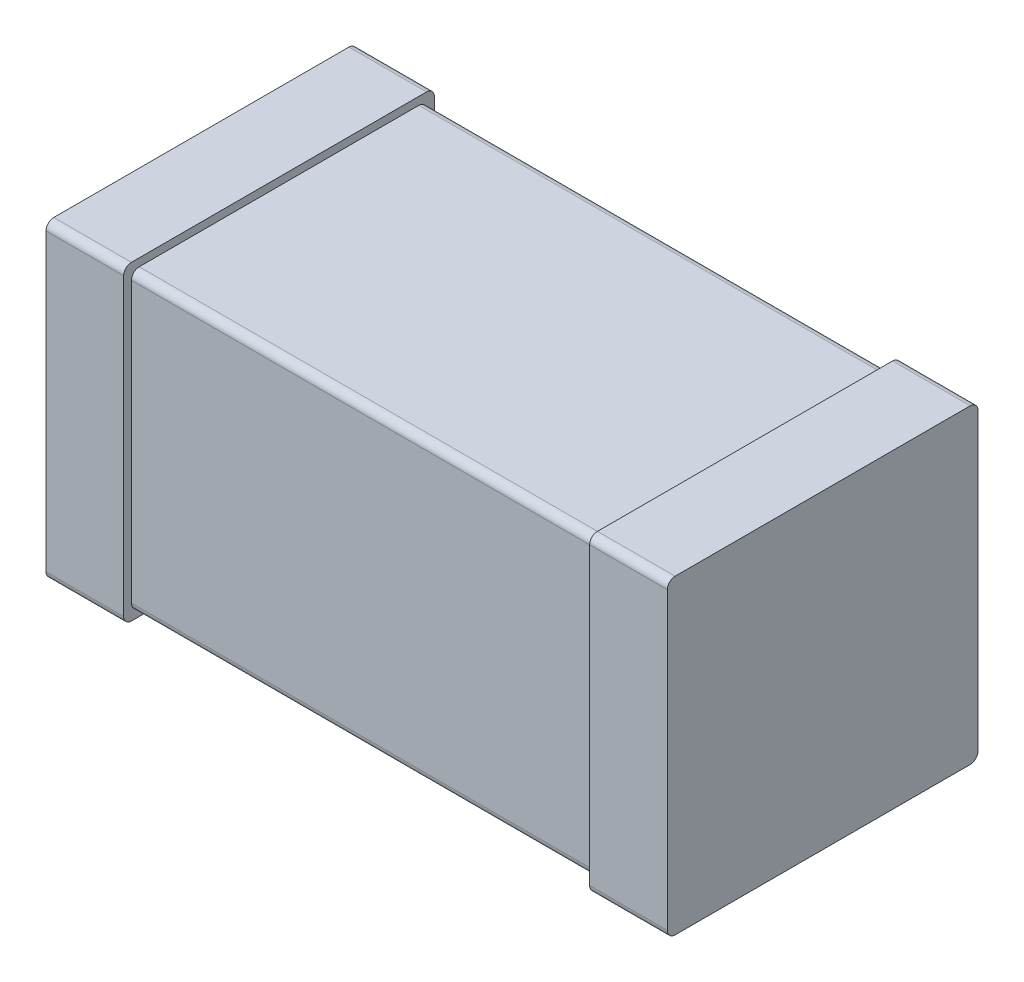
ISO-10303-21;
HEADER;
FILE_DESCRIPTION(('STEP AP214'),'2;1');
FILE_NAME('part.step','',(''),(''),'','','');
FILE_SCHEMA(('AUTOMOTIVE_DESIGN { 1 0 10303 214 1 1 1 1 }'));
ENDSEC;
DATA;
#1=APPLICATION_CONTEXT('core data for automotive mechanical design processes');
#2=APPLICATION_PROTOCOL_DEFINITION('international standard','automotive_design',2000,#1);
#3=PRODUCT_CONTEXT('',#1,'mechanical');
#4=PRODUCT('Part','Part','',(#3));
#5=PRODUCT_RELATED_PRODUCT_CATEGORY('part','',(#4));
#6=PRODUCT_DEFINITION_FORMATION('','',#4);
#7=PRODUCT_DEFINITION_CONTEXT('part definition',#1,'design');
#8=PRODUCT_DEFINITION('design','',#6,#7);
#9=PRODUCT_DEFINITION_SHAPE('','',#8);
#10=(LENGTH_UNIT() NAMED_UNIT(*) SI_UNIT(.MILLI.,.METRE.));
#11=(NAMED_UNIT(*) PLANE_ANGLE_UNIT() SI_UNIT($,.RADIAN.));
#12=(NAMED_UNIT(*) SI_UNIT($,.STERADIAN.) SOLID_ANGLE_UNIT());
#13=UNCERTAINTY_MEASURE_WITH_UNIT(LENGTH_MEASURE(1.E-05),#10,'distance_accuracy_value','');
#14=(GEOMETRIC_REPRESENTATION_CONTEXT(3) GLOBAL_UNCERTAINTY_ASSIGNED_CONTEXT((#13)) GLOBAL_UNIT_ASSIGNED_CONTEXT((#10,
#11,#12)) REPRESENTATION_CONTEXT('',''));
#15=CARTESIAN_POINT('',(0.,0.,0.));
#16=DIRECTION('',(0.,0.,1.));
#17=DIRECTION('',(1.,0.,0.));
#18=AXIS2_PLACEMENT_3D('',#15,#16,#17);
#19=CARTESIAN_POINT('',(1.6,-0.8,0.));
#20=DIRECTION('',(1.,0.,0.));
#21=DIRECTION('',(0.,1.,0.));
#22=AXIS2_PLACEMENT_3D('',#19,#20,#21);
#23=PLANE('',#22);
#24=DIRECTION('',(0.,0.,1.));
#25=VECTOR('',#24,1.);
#26=CARTESIAN_POINT('',(1.6,-0.8,0.));
#27=LINE('',#26,#25);
#28=CARTESIAN_POINT('',(1.6,-0.8,0.04));
#29=VERTEX_POINT('',#28);
#30=CARTESIAN_POINT('',(1.6,-0.8,1.56));
#31=VERTEX_POINT('',#30);
#32=EDGE_CURVE('E357',#29,#31,#27,.T.);
#33=ORIENTED_EDGE('',*,*,#32,.F.);
#34=CARTESIAN_POINT('',(1.6,-0.76,0.04));
#35=DIRECTION('',(1.,0.,0.));
#36=DIRECTION('',(0.,0.,1.));
#37=AXIS2_PLACEMENT_3D('',#34,#35,#36);
#38=CIRCLE('',#37,0.04);
#39=CARTESIAN_POINT('',(1.6,-0.76,0.));
#40=VERTEX_POINT('',#39);
#41=EDGE_CURVE('E377',#29,#40,#38,.T.);
#42=ORIENTED_EDGE('',*,*,#41,.T.);
#43=DIRECTION('',(0.,1.,0.));
#44=VECTOR('',#43,1.);
#45=CARTESIAN_POINT('',(1.6,-0.8,0.));
#46=LINE('',#45,#44);
#47=CARTESIAN_POINT('',(1.6,0.76,0.));
#48=VERTEX_POINT('',#47);
#49=EDGE_CURVE('E335',#40,#48,#46,.T.);
#50=ORIENTED_EDGE('',*,*,#49,.T.);
#51=CARTESIAN_POINT('',(1.6,0.76,0.04));
#52=DIRECTION('',(-1.,0.,0.));
#53=DIRECTION('',(0.,0.,1.));
#54=AXIS2_PLACEMENT_3D('',#51,#52,#53);
#55=CIRCLE('',#54,0.04);
#56=CARTESIAN_POINT('',(1.6,0.8,0.04));
#57=VERTEX_POINT('',#56);
#58=EDGE_CURVE('E370',#57,#48,#55,.T.);
#59=ORIENTED_EDGE('',*,*,#58,.F.);
#60=DIRECTION('',(0.,0.,1.));
#61=VECTOR('',#60,1.);
#62=CARTESIAN_POINT('',(1.6,0.8,0.));
#63=LINE('',#62,#61);
#64=CARTESIAN_POINT('',(1.6,0.8,1.56));
#65=VERTEX_POINT('',#64);
#66=EDGE_CURVE('E11',#57,#65,#63,.T.);
#67=ORIENTED_EDGE('',*,*,#66,.T.);
#68=CARTESIAN_POINT('',(1.6,0.76,1.56));
#69=DIRECTION('',(1.,0.,0.));
#70=DIRECTION('',(0.,0.,1.));
#71=AXIS2_PLACEMENT_3D('',#68,#69,#70);
#72=CIRCLE('',#71,0.04);
#73=CARTESIAN_POINT('',(1.6,0.76,1.6));
#74=VERTEX_POINT('',#73);
#75=EDGE_CURVE('E367',#65,#74,#72,.T.);
#76=ORIENTED_EDGE('',*,*,#75,.T.);
#77=DIRECTION('',(0.,1.,0.));
#78=VECTOR('',#77,1.);
#79=CARTESIAN_POINT('',(1.6,-0.8,1.6));
#80=LINE('',#79,#78);
#81=CARTESIAN_POINT('',(1.6,-0.76,1.6));
#82=VERTEX_POINT('',#81);
#83=EDGE_CURVE('E330',#82,#74,#80,.T.);
#84=ORIENTED_EDGE('',*,*,#83,.F.);
#85=CARTESIAN_POINT('',(1.6,-0.76,1.56));
#86=DIRECTION('',(-1.,0.,0.));
#87=DIRECTION('',(0.,0.,1.));
#88=AXIS2_PLACEMENT_3D('',#85,#86,#87);
#89=CIRCLE('',#88,0.04);
#90=EDGE_CURVE('E381',#31,#82,#89,.T.);
#91=ORIENTED_EDGE('',*,*,#90,.F.);
#92=EDGE_LOOP('',(#33,#42,#50,#59,#67,#76,#84,#91));
#93=FACE_BOUND('',#92,.T.);
#94=ADVANCED_FACE('F16',(#93),#23,.T.);
#95=CARTESIAN_POINT('',(1.2,0.8,0.));
#96=DIRECTION('',(0.,1.,0.));
#97=DIRECTION('',(1.,0.,0.));
#98=AXIS2_PLACEMENT_3D('',#95,#96,#97);
#99=PLANE('',#98);
#100=ORIENTED_EDGE('',*,*,#66,.F.);
#101=DIRECTION('',(1.,0.,0.));
#102=VECTOR('',#101,1.);
#103=CARTESIAN_POINT('',(1.2,0.8,0.04));
#104=LINE('',#103,#102);
#105=CARTESIAN_POINT('',(1.2,0.8,0.04));
#106=VERTEX_POINT('',#105);
#107=EDGE_CURVE('E425',#106,#57,#104,.T.);
#108=ORIENTED_EDGE('',*,*,#107,.F.);
#109=DIRECTION('',(0.,0.,1.));
#110=VECTOR('',#109,1.);
#111=CARTESIAN_POINT('',(1.2,0.8,0.));
#112=LINE('',#111,#110);
#113=CARTESIAN_POINT('',(1.2,0.8,1.56));
#114=VERTEX_POINT('',#113);
#115=EDGE_CURVE('E400',#106,#114,#112,.T.);
#116=ORIENTED_EDGE('',*,*,#115,.T.);
#117=DIRECTION('',(1.,0.,0.));
#118=VECTOR('',#117,1.);
#119=CARTESIAN_POINT('',(1.2,0.8,1.56));
#120=LINE('',#119,#118);
#121=EDGE_CURVE('E27',#114,#65,#120,.T.);
#122=ORIENTED_EDGE('',*,*,#121,.T.);
#123=EDGE_LOOP('',(#100,#108,#116,#122));
#124=FACE_BOUND('',#123,.T.);
#125=ADVANCED_FACE('F493',(#124),#99,.T.);
#126=CARTESIAN_POINT('',(1.2,0.76,1.56));
#127=DIRECTION('',(1.,0.,0.));
#128=DIRECTION('',(0.,1.,0.));
#129=AXIS2_PLACEMENT_3D('',#126,#127,#128);
#130=CYLINDRICAL_SURFACE('',#129,0.04);
#131=CARTESIAN_POINT('',(1.2,0.76,1.56));
#132=DIRECTION('',(1.,0.,0.));
#133=DIRECTION('',(0.,0.,1.));
#134=AXIS2_PLACEMENT_3D('',#131,#132,#133);
#135=CIRCLE('',#134,0.04);
#136=CARTESIAN_POINT('',(1.2,0.76,1.6));
#137=VERTEX_POINT('',#136);
#138=EDGE_CURVE('E346',#114,#137,#135,.T.);
#139=ORIENTED_EDGE('',*,*,#138,.T.);
#140=DIRECTION('',(1.,0.,0.));
#141=VECTOR('',#140,1.);
#142=CARTESIAN_POINT('',(1.2,0.76,1.6));
#143=LINE('',#142,#141);
#144=EDGE_CURVE('E334',#137,#74,#143,.T.);
#145=ORIENTED_EDGE('',*,*,#144,.T.);
#146=ORIENTED_EDGE('',*,*,#75,.F.);
#147=ORIENTED_EDGE('',*,*,#121,.F.);
#148=EDGE_LOOP('',(#139,#145,#146,#147));
#149=FACE_BOUND('',#148,.T.);
#150=ADVANCED_FACE('F497',(#149),#130,.T.);
#151=CARTESIAN_POINT('',(1.2,0.76,0.04));
#152=DIRECTION('',(1.,0.,0.));
#153=DIRECTION('',(0.,1.,0.));
#154=AXIS2_PLACEMENT_3D('',#151,#152,#153);
#155=CYLINDRICAL_SURFACE('',#154,0.04);
#156=ORIENTED_EDGE('',*,*,#107,.T.);
#157=ORIENTED_EDGE('',*,*,#58,.T.);
#158=DIRECTION('',(1.,0.,0.));
#159=VECTOR('',#158,1.);
#160=CARTESIAN_POINT('',(1.2,0.76,0.));
#161=LINE('',#160,#159);
#162=CARTESIAN_POINT('',(1.2,0.76,0.));
#163=VERTEX_POINT('',#162);
#164=EDGE_CURVE('E417',#163,#48,#161,.T.);
#165=ORIENTED_EDGE('',*,*,#164,.F.);
#166=CARTESIAN_POINT('',(1.2,0.76,0.04));
#167=DIRECTION('',(-1.,0.,0.));
#168=DIRECTION('',(0.,0.,1.));
#169=AXIS2_PLACEMENT_3D('',#166,#167,#168);
#170=CIRCLE('',#169,0.04);
#171=EDGE_CURVE('E395',#106,#163,#170,.T.);
#172=ORIENTED_EDGE('',*,*,#171,.F.);
#173=EDGE_LOOP('',(#156,#157,#165,#172));
#174=FACE_BOUND('',#173,.T.);
#175=ADVANCED_FACE('F518',(#174),#155,.T.);
#176=CARTESIAN_POINT('',(1.2,-0.8,1.6));
#177=DIRECTION('',(0.,0.,1.));
#178=DIRECTION('',(1.,0.,0.));
#179=AXIS2_PLACEMENT_3D('',#176,#177,#178);
#180=PLANE('',#179);
#181=DIRECTION('',(0.,1.,0.));
#182=VECTOR('',#181,1.);
#183=CARTESIAN_POINT('',(1.2,-0.8,1.6));
#184=LINE('',#183,#182);
#185=CARTESIAN_POINT('',(1.2,-0.76,1.6));
#186=VERTEX_POINT('',#185);
#187=EDGE_CURVE('E342',#186,#137,#184,.T.);
#188=ORIENTED_EDGE('',*,*,#187,.F.);
#189=DIRECTION('',(1.,0.,0.));
#190=VECTOR('',#189,1.);
#191=CARTESIAN_POINT('',(1.2,-0.76,1.6));
#192=LINE('',#191,#190);
#193=EDGE_CURVE('E411',#186,#82,#192,.T.);
#194=ORIENTED_EDGE('',*,*,#193,.T.);
#195=ORIENTED_EDGE('',*,*,#83,.T.);
#196=ORIENTED_EDGE('',*,*,#144,.F.);
#197=EDGE_LOOP('',(#188,#194,#195,#196));
#198=FACE_BOUND('',#197,.T.);
#199=ADVANCED_FACE('F501',(#198),#180,.T.);
#200=CARTESIAN_POINT('',(1.2,-0.8,0.));
#201=DIRECTION('',(0.,0.,1.));
#202=DIRECTION('',(1.,0.,0.));
#203=AXIS2_PLACEMENT_3D('',#200,#201,#202);
#204=PLANE('',#203);
#205=ORIENTED_EDGE('',*,*,#164,.T.);
#206=ORIENTED_EDGE('',*,*,#49,.F.);
#207=DIRECTION('',(1.,0.,0.));
#208=VECTOR('',#207,1.);
#209=CARTESIAN_POINT('',(1.2,-0.76,0.));
#210=LINE('',#209,#208);
#211=CARTESIAN_POINT('',(1.2,-0.76,0.));
#212=VERTEX_POINT('',#211);
#213=EDGE_CURVE('E382',#212,#40,#210,.T.);
#214=ORIENTED_EDGE('',*,*,#213,.F.);
#215=DIRECTION('',(0.,1.,0.));
#216=VECTOR('',#215,1.);
#217=CARTESIAN_POINT('',(1.2,-0.8,0.));
#218=LINE('',#217,#216);
#219=EDGE_CURVE('E399',#212,#163,#218,.T.);
#220=ORIENTED_EDGE('',*,*,#219,.T.);
#221=EDGE_LOOP('',(#205,#206,#214,#220));
#222=FACE_BOUND('',#221,.T.);
#223=ADVANCED_FACE('F515',(#222),#204,.F.);
#224=CARTESIAN_POINT('',(1.2,-0.76,1.56));
#225=DIRECTION('',(1.,0.,0.));
#226=DIRECTION('',(0.,-1.,0.));
#227=AXIS2_PLACEMENT_3D('',#224,#225,#226);
#228=CYLINDRICAL_SURFACE('',#227,0.04);
#229=DIRECTION('',(1.,0.,0.));
#230=VECTOR('',#229,1.);
#231=CARTESIAN_POINT('',(1.2,-0.8,1.56));
#232=LINE('',#231,#230);
#233=CARTESIAN_POINT('',(1.2,-0.8,1.56));
#234=VERTEX_POINT('',#233);
#235=EDGE_CURVE('E336',#234,#31,#232,.T.);
#236=ORIENTED_EDGE('',*,*,#235,.T.);
#237=ORIENTED_EDGE('',*,*,#90,.T.);
#238=ORIENTED_EDGE('',*,*,#193,.F.);
#239=CARTESIAN_POINT('',(1.2,-0.76,1.56));
#240=DIRECTION('',(-1.,0.,0.));
#241=DIRECTION('',(0.,0.,1.));
#242=AXIS2_PLACEMENT_3D('',#239,#240,#241);
#243=CIRCLE('',#242,0.04);
#244=EDGE_CURVE('E329',#234,#186,#243,.T.);
#245=ORIENTED_EDGE('',*,*,#244,.F.);
#246=EDGE_LOOP('',(#236,#237,#238,#245));
#247=FACE_BOUND('',#246,.T.);
#248=ADVANCED_FACE('F18',(#247),#228,.T.);
#249=CARTESIAN_POINT('',(1.2,-0.76,0.04));
#250=DIRECTION('',(1.,0.,0.));
#251=DIRECTION('',(0.,-1.,0.));
#252=AXIS2_PLACEMENT_3D('',#249,#250,#251);
#253=CYLINDRICAL_SURFACE('',#252,0.04);
#254=CARTESIAN_POINT('',(1.2,-0.76,0.04));
#255=DIRECTION('',(1.,0.,0.));
#256=DIRECTION('',(0.,0.,1.));
#257=AXIS2_PLACEMENT_3D('',#254,#255,#256);
#258=CIRCLE('',#257,0.04);
#259=CARTESIAN_POINT('',(1.2,-0.8,0.04));
#260=VERTEX_POINT('',#259);
#261=EDGE_CURVE('E386',#260,#212,#258,.T.);
#262=ORIENTED_EDGE('',*,*,#261,.T.);
#263=ORIENTED_EDGE('',*,*,#213,.T.);
#264=ORIENTED_EDGE('',*,*,#41,.F.);
#265=DIRECTION('',(1.,0.,0.));
#266=VECTOR('',#265,1.);
#267=CARTESIAN_POINT('',(1.2,-0.8,0.04));
#268=LINE('',#267,#266);
#269=EDGE_CURVE('E340',#260,#29,#268,.T.);
#270=ORIENTED_EDGE('',*,*,#269,.F.);
#271=EDGE_LOOP('',(#262,#263,#264,#270));
#272=FACE_BOUND('',#271,.T.);
#273=ADVANCED_FACE('F513',(#272),#253,.T.);
#274=CARTESIAN_POINT('',(1.2,-0.8,0.));
#275=DIRECTION('',(0.,1.,0.));
#276=DIRECTION('',(1.,0.,0.));
#277=AXIS2_PLACEMENT_3D('',#274,#275,#276);
#278=PLANE('',#277);
#279=ORIENTED_EDGE('',*,*,#235,.F.);
#280=DIRECTION('',(0.,0.,1.));
#281=VECTOR('',#280,1.);
#282=CARTESIAN_POINT('',(1.2,-0.8,0.));
#283=LINE('',#282,#281);
#284=EDGE_CURVE('E341',#260,#234,#283,.T.);
#285=ORIENTED_EDGE('',*,*,#284,.F.);
#286=ORIENTED_EDGE('',*,*,#269,.T.);
#287=ORIENTED_EDGE('',*,*,#32,.T.);
#288=EDGE_LOOP('',(#279,#285,#286,#287));
#289=FACE_BOUND('',#288,.T.);
#290=ADVANCED_FACE('F506',(#289),#278,.F.);
#291=CARTESIAN_POINT('',(1.2,-0.8,0.));
#292=DIRECTION('',(1.,0.,0.));
#293=DIRECTION('',(0.,1.,0.));
#294=AXIS2_PLACEMENT_3D('',#291,#292,#293);
#295=PLANE('',#294);
#296=DIRECTION('',(0.,1.,0.));
#297=VECTOR('',#296,1.);
#298=CARTESIAN_POINT('',(1.2,-0.76,0.04));
#299=LINE('',#298,#297);
#300=CARTESIAN_POINT('',(1.2,-0.72,0.04));
#301=VERTEX_POINT('',#300);
#302=CARTESIAN_POINT('',(1.2,0.72,0.04));
#303=VERTEX_POINT('',#302);
#304=EDGE_CURVE('E269',#301,#303,#299,.T.);
#305=ORIENTED_EDGE('',*,*,#304,.T.);
#306=CARTESIAN_POINT('',(1.2,0.72,0.08));
#307=DIRECTION('',(-1.,0.,0.));
#308=DIRECTION('',(0.,0.,1.));
#309=AXIS2_PLACEMENT_3D('',#306,#307,#308);
#310=CIRCLE('',#309,0.04);
#311=CARTESIAN_POINT('',(1.2,0.76,0.08));
#312=VERTEX_POINT('',#311);
#313=EDGE_CURVE('E316',#312,#303,#310,.T.);
#314=ORIENTED_EDGE('',*,*,#313,.F.);
#315=DIRECTION('',(0.,0.,1.));
#316=VECTOR('',#315,1.);
#317=CARTESIAN_POINT('',(1.2,0.76,0.04));
#318=LINE('',#317,#316);
#319=CARTESIAN_POINT('',(1.2,0.76,1.52));
#320=VERTEX_POINT('',#319);
#321=EDGE_CURVE('E319',#312,#320,#318,.T.);
#322=ORIENTED_EDGE('',*,*,#321,.T.);
#323=CARTESIAN_POINT('',(1.2,0.72,1.52));
#324=DIRECTION('',(1.,0.,0.));
#325=DIRECTION('',(0.,0.,1.));
#326=AXIS2_PLACEMENT_3D('',#323,#324,#325);
#327=CIRCLE('',#326,0.04);
#328=CARTESIAN_POINT('',(1.2,0.72,1.56));
#329=VERTEX_POINT('',#328);
#330=EDGE_CURVE('E321',#320,#329,#327,.T.);
#331=ORIENTED_EDGE('',*,*,#330,.T.);
#332=DIRECTION('',(0.,1.,0.));
#333=VECTOR('',#332,1.);
#334=CARTESIAN_POINT('',(1.2,-0.76,1.56));
#335=LINE('',#334,#333);
#336=CARTESIAN_POINT('',(1.2,-0.72,1.56));
#337=VERTEX_POINT('',#336);
#338=EDGE_CURVE('E279',#337,#329,#335,.T.);
#339=ORIENTED_EDGE('',*,*,#338,.F.);
#340=CARTESIAN_POINT('',(1.2,-0.72,1.52));
#341=DIRECTION('',(-1.,0.,0.));
#342=DIRECTION('',(0.,0.,1.));
#343=AXIS2_PLACEMENT_3D('',#340,#341,#342);
#344=CIRCLE('',#343,0.04);
#345=CARTESIAN_POINT('',(1.2,-0.76,1.52));
#346=VERTEX_POINT('',#345);
#347=EDGE_CURVE('E186',#346,#337,#344,.T.);
#348=ORIENTED_EDGE('',*,*,#347,.F.);
#349=DIRECTION('',(0.,0.,1.));
#350=VECTOR('',#349,1.);
#351=CARTESIAN_POINT('',(1.2,-0.76,0.04));
#352=LINE('',#351,#350);
#353=CARTESIAN_POINT('',(1.2,-0.76,0.08));
#354=VERTEX_POINT('',#353);
#355=EDGE_CURVE('E175',#354,#346,#352,.T.);
#356=ORIENTED_EDGE('',*,*,#355,.F.);
#357=CARTESIAN_POINT('',(1.2,-0.72,0.08));
#358=DIRECTION('',(1.,0.,0.));
#359=DIRECTION('',(0.,0.,1.));
#360=AXIS2_PLACEMENT_3D('',#357,#358,#359);
#361=CIRCLE('',#360,0.04);
#362=EDGE_CURVE('E284',#354,#301,#361,.T.);
#363=ORIENTED_EDGE('',*,*,#362,.T.);
#364=EDGE_LOOP('',(#305,#314,#322,#331,#339,#348,#356,#363));
#365=FACE_BOUND('',#364,.T.);
#366=ORIENTED_EDGE('',*,*,#244,.T.);
#367=ORIENTED_EDGE('',*,*,#187,.T.);
#368=ORIENTED_EDGE('',*,*,#138,.F.);
#369=ORIENTED_EDGE('',*,*,#115,.F.);
#370=ORIENTED_EDGE('',*,*,#171,.T.);
#371=ORIENTED_EDGE('',*,*,#219,.F.);
#372=ORIENTED_EDGE('',*,*,#261,.F.);
#373=ORIENTED_EDGE('',*,*,#284,.T.);
#374=EDGE_LOOP('',(#366,#367,#368,#369,#370,#371,#372,#373));
#375=FACE_BOUND('',#374,.T.);
#376=ADVANCED_FACE('F509',(#365,#375),#295,.F.);
#377=CARTESIAN_POINT('',(-1.2,-0.76,0.04));
#378=DIRECTION('',(0.,1.,0.));
#379=DIRECTION('',(1.,0.,0.));
#380=AXIS2_PLACEMENT_3D('',#377,#378,#379);
#381=PLANE('',#380);
#382=DIRECTION('',(1.,0.,0.));
#383=VECTOR('',#382,1.);
#384=CARTESIAN_POINT('',(-1.2,-0.76,1.52));
#385=LINE('',#384,#383);
#386=CARTESIAN_POINT('',(-1.2,-0.76,1.52));
#387=VERTEX_POINT('',#386);
#388=EDGE_CURVE('E276',#387,#346,#385,.T.);
#389=ORIENTED_EDGE('',*,*,#388,.F.);
#390=DIRECTION('',(0.,0.,1.));
#391=VECTOR('',#390,1.);
#392=CARTESIAN_POINT('',(-1.2,-0.76,0.04));
#393=LINE('',#392,#391);
#394=CARTESIAN_POINT('',(-1.2,-0.76,0.08));
#395=VERTEX_POINT('',#394);
#396=EDGE_CURVE('E310',#395,#387,#393,.T.);
#397=ORIENTED_EDGE('',*,*,#396,.F.);
#398=DIRECTION('',(1.,0.,0.));
#399=VECTOR('',#398,1.);
#400=CARTESIAN_POINT('',(-1.2,-0.76,0.08));
#401=LINE('',#400,#399);
#402=EDGE_CURVE('E434',#395,#354,#401,.T.);
#403=ORIENTED_EDGE('',*,*,#402,.T.);
#404=ORIENTED_EDGE('',*,*,#355,.T.);
#405=EDGE_LOOP('',(#389,#397,#403,#404));
#406=FACE_BOUND('',#405,.T.);
#407=ADVANCED_FACE('F576',(#406),#381,.F.);
#408=CARTESIAN_POINT('',(-1.2,-0.72,1.52));
#409=DIRECTION('',(1.,0.,0.));
#410=DIRECTION('',(0.,-1.,0.));
#411=AXIS2_PLACEMENT_3D('',#408,#409,#410);
#412=CYLINDRICAL_SURFACE('',#411,0.04);
#413=ORIENTED_EDGE('',*,*,#388,.T.);
#414=ORIENTED_EDGE('',*,*,#347,.T.);
#415=DIRECTION('',(1.,0.,0.));
#416=VECTOR('',#415,1.);
#417=CARTESIAN_POINT('',(-1.2,-0.72,1.56));
#418=LINE('',#417,#416);
#419=CARTESIAN_POINT('',(-1.2,-0.72,1.56));
#420=VERTEX_POINT('',#419);
#421=EDGE_CURVE('E325',#420,#337,#418,.T.);
#422=ORIENTED_EDGE('',*,*,#421,.F.);
#423=CARTESIAN_POINT('',(-1.2,-0.72,1.52));
#424=DIRECTION('',(-1.,0.,0.));
#425=DIRECTION('',(0.,0.,1.));
#426=AXIS2_PLACEMENT_3D('',#423,#424,#425);
#427=CIRCLE('',#426,0.04);
#428=EDGE_CURVE('E305',#387,#420,#427,.T.);
#429=ORIENTED_EDGE('',*,*,#428,.F.);
#430=EDGE_LOOP('',(#413,#414,#422,#429));
#431=FACE_BOUND('',#430,.T.);
#432=ADVANCED_FACE('F565',(#431),#412,.T.);
#433=CARTESIAN_POINT('',(-1.2,-0.76,1.56));
#434=DIRECTION('',(0.,0.,1.));
#435=DIRECTION('',(1.,0.,0.));
#436=AXIS2_PLACEMENT_3D('',#433,#434,#435);
#437=PLANE('',#436);
#438=DIRECTION('',(0.,1.,0.));
#439=VECTOR('',#438,1.);
#440=CARTESIAN_POINT('',(-1.2,-0.76,1.56));
#441=LINE('',#440,#439);
#442=CARTESIAN_POINT('',(-1.2,0.72,1.56));
#443=VERTEX_POINT('',#442);
#444=EDGE_CURVE('E309',#420,#443,#441,.T.);
#445=ORIENTED_EDGE('',*,*,#444,.F.);
#446=ORIENTED_EDGE('',*,*,#421,.T.);
#447=ORIENTED_EDGE('',*,*,#338,.T.);
#448=DIRECTION('',(1.,0.,0.));
#449=VECTOR('',#448,1.);
#450=CARTESIAN_POINT('',(-1.2,0.72,1.56));
#451=LINE('',#450,#449);
#452=EDGE_CURVE('E326',#443,#329,#451,.T.);
#453=ORIENTED_EDGE('',*,*,#452,.F.);
#454=EDGE_LOOP('',(#445,#446,#447,#453));
#455=FACE_BOUND('',#454,.T.);
#456=ADVANCED_FACE('F561',(#455),#437,.T.);
#457=CARTESIAN_POINT('',(-1.2,0.72,1.52));
#458=DIRECTION('',(1.,0.,0.));
#459=DIRECTION('',(0.,1.,0.));
#460=AXIS2_PLACEMENT_3D('',#457,#458,#459);
#461=CYLINDRICAL_SURFACE('',#460,0.04);
#462=CARTESIAN_POINT('',(-1.2,0.72,1.52));
#463=DIRECTION('',(1.,0.,0.));
#464=DIRECTION('',(0.,0.,1.));
#465=AXIS2_PLACEMENT_3D('',#462,#463,#464);
#466=CIRCLE('',#465,0.04);
#467=CARTESIAN_POINT('',(-1.2,0.76,1.52));
#468=VERTEX_POINT('',#467);
#469=EDGE_CURVE('E315',#468,#443,#466,.T.);
#470=ORIENTED_EDGE('',*,*,#469,.T.);
#471=ORIENTED_EDGE('',*,*,#452,.T.);
#472=ORIENTED_EDGE('',*,*,#330,.F.);
#473=DIRECTION('',(1.,0.,0.));
#474=VECTOR('',#473,1.);
#475=CARTESIAN_POINT('',(-1.2,0.76,1.52));
#476=LINE('',#475,#474);
#477=EDGE_CURVE('E350',#468,#320,#476,.T.);
#478=ORIENTED_EDGE('',*,*,#477,.F.);
#479=EDGE_LOOP('',(#470,#471,#472,#478));
#480=FACE_BOUND('',#479,.T.);
#481=ADVANCED_FACE('F564',(#480),#461,.T.);
#482=CARTESIAN_POINT('',(-1.2,0.76,0.04));
#483=DIRECTION('',(0.,1.,0.));
#484=DIRECTION('',(1.,0.,0.));
#485=AXIS2_PLACEMENT_3D('',#482,#483,#484);
#486=PLANE('',#485);
#487=ORIENTED_EDGE('',*,*,#321,.F.);
#488=DIRECTION('',(1.,0.,0.));
#489=VECTOR('',#488,1.);
#490=CARTESIAN_POINT('',(-1.2,0.76,0.08));
#491=LINE('',#490,#489);
#492=CARTESIAN_POINT('',(-1.2,0.76,0.08));
#493=VERTEX_POINT('',#492);
#494=EDGE_CURVE('E320',#493,#312,#491,.T.);
#495=ORIENTED_EDGE('',*,*,#494,.F.);
#496=DIRECTION('',(0.,0.,1.));
#497=VECTOR('',#496,1.);
#498=CARTESIAN_POINT('',(-1.2,0.76,0.04));
#499=LINE('',#498,#497);
#500=EDGE_CURVE('E311',#493,#468,#499,.T.);
#501=ORIENTED_EDGE('',*,*,#500,.T.);
#502=ORIENTED_EDGE('',*,*,#477,.T.);
#503=EDGE_LOOP('',(#487,#495,#501,#502));
#504=FACE_BOUND('',#503,.T.);
#505=ADVANCED_FACE('F571',(#504),#486,.T.);
#506=CARTESIAN_POINT('',(-1.2,0.72,0.08));
#507=DIRECTION('',(1.,0.,0.));
#508=DIRECTION('',(0.,1.,0.));
#509=AXIS2_PLACEMENT_3D('',#506,#507,#508);
#510=CYLINDRICAL_SURFACE('',#509,0.04);
#511=ORIENTED_EDGE('',*,*,#494,.T.);
#512=ORIENTED_EDGE('',*,*,#313,.T.);
#513=DIRECTION('',(1.,0.,0.));
#514=VECTOR('',#513,1.);
#515=CARTESIAN_POINT('',(-1.2,0.72,0.04));
#516=LINE('',#515,#514);
#517=CARTESIAN_POINT('',(-1.2,0.72,0.04));
#518=VERTEX_POINT('',#517);
#519=EDGE_CURVE('E451',#518,#303,#516,.T.);
#520=ORIENTED_EDGE('',*,*,#519,.F.);
#521=CARTESIAN_POINT('',(-1.2,0.72,0.08));
#522=DIRECTION('',(-1.,0.,0.));
#523=DIRECTION('',(0.,0.,1.));
#524=AXIS2_PLACEMENT_3D('',#521,#522,#523);
#525=CIRCLE('',#524,0.04);
#526=EDGE_CURVE('E295',#493,#518,#525,.T.);
#527=ORIENTED_EDGE('',*,*,#526,.F.);
#528=EDGE_LOOP('',(#511,#512,#520,#527));
#529=FACE_BOUND('',#528,.T.);
#530=ADVANCED_FACE('F574',(#529),#510,.T.);
#531=CARTESIAN_POINT('',(-1.2,-0.76,0.04));
#532=DIRECTION('',(0.,0.,1.));
#533=DIRECTION('',(1.,0.,0.));
#534=AXIS2_PLACEMENT_3D('',#531,#532,#533);
#535=PLANE('',#534);
#536=ORIENTED_EDGE('',*,*,#519,.T.);
#537=ORIENTED_EDGE('',*,*,#304,.F.);
#538=DIRECTION('',(1.,0.,0.));
#539=VECTOR('',#538,1.);
#540=CARTESIAN_POINT('',(-1.2,-0.72,0.04));
#541=LINE('',#540,#539);
#542=CARTESIAN_POINT('',(-1.2,-0.72,0.04));
#543=VERTEX_POINT('',#542);
#544=EDGE_CURVE('E280',#543,#301,#541,.T.);
#545=ORIENTED_EDGE('',*,*,#544,.F.);
#546=DIRECTION('',(0.,1.,0.));
#547=VECTOR('',#546,1.);
#548=CARTESIAN_POINT('',(-1.2,-0.76,0.04));
#549=LINE('',#548,#547);
#550=EDGE_CURVE('E285',#543,#518,#549,.T.);
#551=ORIENTED_EDGE('',*,*,#550,.T.);
#552=EDGE_LOOP('',(#536,#537,#545,#551));
#553=FACE_BOUND('',#552,.T.);
#554=ADVANCED_FACE('F594',(#553),#535,.F.);
#555=CARTESIAN_POINT('',(-1.2,-0.72,0.08));
#556=DIRECTION('',(1.,0.,0.));
#557=DIRECTION('',(0.,-1.,0.));
#558=AXIS2_PLACEMENT_3D('',#555,#556,#557);
#559=CYLINDRICAL_SURFACE('',#558,0.04);
#560=CARTESIAN_POINT('',(-1.2,-0.72,0.08));
#561=DIRECTION('',(1.,0.,0.));
#562=DIRECTION('',(0.,0.,1.));
#563=AXIS2_PLACEMENT_3D('',#560,#561,#562);
#564=CIRCLE('',#563,0.04);
#565=EDGE_CURVE('E251',#395,#543,#564,.T.);
#566=ORIENTED_EDGE('',*,*,#565,.T.);
#567=ORIENTED_EDGE('',*,*,#544,.T.);
#568=ORIENTED_EDGE('',*,*,#362,.F.);
#569=ORIENTED_EDGE('',*,*,#402,.F.);
#570=EDGE_LOOP('',(#566,#567,#568,#569));
#571=FACE_BOUND('',#570,.T.);
#572=ADVANCED_FACE('F588',(#571),#559,.T.);
#573=CARTESIAN_POINT('',(-1.2,-0.8,0.));
#574=DIRECTION('',(1.,0.,0.));
#575=DIRECTION('',(0.,1.,0.));
#576=AXIS2_PLACEMENT_3D('',#573,#574,#575);
#577=PLANE('',#576);
#578=ORIENTED_EDGE('',*,*,#565,.F.);
#579=ORIENTED_EDGE('',*,*,#396,.T.);
#580=ORIENTED_EDGE('',*,*,#428,.T.);
#581=ORIENTED_EDGE('',*,*,#444,.T.);
#582=ORIENTED_EDGE('',*,*,#469,.F.);
#583=ORIENTED_EDGE('',*,*,#500,.F.);
#584=ORIENTED_EDGE('',*,*,#526,.T.);
#585=ORIENTED_EDGE('',*,*,#550,.F.);
#586=EDGE_LOOP('',(#578,#579,#580,#581,#582,#583,#584,#585));
#587=FACE_BOUND('',#586,.T.);
#588=DIRECTION('',(0.,0.,1.));
#589=VECTOR('',#588,1.);
#590=CARTESIAN_POINT('',(-1.2,-0.8,0.));
#591=LINE('',#590,#589);
#592=CARTESIAN_POINT('',(-1.2,-0.8,0.04));
#593=VERTEX_POINT('',#592);
#594=CARTESIAN_POINT('',(-1.2,-0.8,1.56));
#595=VERTEX_POINT('',#594);
#596=EDGE_CURVE('E299',#593,#595,#591,.T.);
#597=ORIENTED_EDGE('',*,*,#596,.F.);
#598=CARTESIAN_POINT('',(-1.2,-0.76,0.04));
#599=DIRECTION('',(1.,0.,0.));
#600=DIRECTION('',(0.,0.,1.));
#601=AXIS2_PLACEMENT_3D('',#598,#599,#600);
#602=CIRCLE('',#601,0.04);
#603=CARTESIAN_POINT('',(-1.2,-0.76,0.));
#604=VERTEX_POINT('',#603);
#605=EDGE_CURVE('E286',#593,#604,#602,.T.);
#606=ORIENTED_EDGE('',*,*,#605,.T.);
#607=DIRECTION('',(0.,1.,0.));
#608=VECTOR('',#607,1.);
#609=CARTESIAN_POINT('',(-1.2,-0.8,0.));
#610=LINE('',#609,#608);
#611=CARTESIAN_POINT('',(-1.2,0.76,0.));
#612=VERTEX_POINT('',#611);
#613=EDGE_CURVE('E407',#604,#612,#610,.T.);
#614=ORIENTED_EDGE('',*,*,#613,.T.);
#615=CARTESIAN_POINT('',(-1.2,0.76,0.04));
#616=DIRECTION('',(-1.,0.,0.));
#617=DIRECTION('',(0.,0.,1.));
#618=AXIS2_PLACEMENT_3D('',#615,#616,#617);
#619=CIRCLE('',#618,0.04);
#620=CARTESIAN_POINT('',(-1.2,0.8,0.04));
#621=VERTEX_POINT('',#620);
#622=EDGE_CURVE('E249',#621,#612,#619,.T.);
#623=ORIENTED_EDGE('',*,*,#622,.F.);
#624=DIRECTION('',(0.,0.,1.));
#625=VECTOR('',#624,1.);
#626=CARTESIAN_POINT('',(-1.2,0.8,0.));
#627=LINE('',#626,#625);
#628=CARTESIAN_POINT('',(-1.2,0.8,1.56));
#629=VERTEX_POINT('',#628);
#630=EDGE_CURVE('E243',#621,#629,#627,.T.);
#631=ORIENTED_EDGE('',*,*,#630,.T.);
#632=CARTESIAN_POINT('',(-1.2,0.76,1.56));
#633=DIRECTION('',(1.,0.,0.));
#634=DIRECTION('',(0.,0.,1.));
#635=AXIS2_PLACEMENT_3D('',#632,#633,#634);
#636=CIRCLE('',#635,0.04);
#637=CARTESIAN_POINT('',(-1.2,0.76,1.6));
#638=VERTEX_POINT('',#637);
#639=EDGE_CURVE('E246',#629,#638,#636,.T.);
#640=ORIENTED_EDGE('',*,*,#639,.T.);
#641=DIRECTION('',(0.,1.,0.));
#642=VECTOR('',#641,1.);
#643=CARTESIAN_POINT('',(-1.2,-0.8,1.6));
#644=LINE('',#643,#642);
#645=CARTESIAN_POINT('',(-1.2,-0.76,1.6));
#646=VERTEX_POINT('',#645);
#647=EDGE_CURVE('E428',#646,#638,#644,.T.);
#648=ORIENTED_EDGE('',*,*,#647,.F.);
#649=CARTESIAN_POINT('',(-1.2,-0.76,1.56));
#650=DIRECTION('',(-1.,0.,0.));
#651=DIRECTION('',(0.,0.,1.));
#652=AXIS2_PLACEMENT_3D('',#649,#650,#651);
#653=CIRCLE('',#652,0.04);
#654=EDGE_CURVE('E290',#595,#646,#653,.T.);
#655=ORIENTED_EDGE('',*,*,#654,.F.);
#656=EDGE_LOOP('',(#597,#606,#614,#623,#631,#640,#648,#655));
#657=FACE_BOUND('',#656,.T.);
#658=ADVANCED_FACE('F245',(#587,#657),#577,.T.);
#659=CARTESIAN_POINT('',(-1.6,0.8,0.));
#660=DIRECTION('',(0.,1.,0.));
#661=DIRECTION('',(1.,0.,0.));
#662=AXIS2_PLACEMENT_3D('',#659,#660,#661);
#663=PLANE('',#662);
#664=ORIENTED_EDGE('',*,*,#630,.F.);
#665=DIRECTION('',(1.,0.,0.));
#666=VECTOR('',#665,1.);
#667=CARTESIAN_POINT('',(-1.6,0.8,0.04));
#668=LINE('',#667,#666);
#669=CARTESIAN_POINT('',(-1.6,0.8,0.04));
#670=VERTEX_POINT('',#669);
#671=EDGE_CURVE('E61',#670,#621,#668,.T.);
#672=ORIENTED_EDGE('',*,*,#671,.F.);
#673=DIRECTION('',(0.,0.,1.));
#674=VECTOR('',#673,1.);
#675=CARTESIAN_POINT('',(-1.6,0.8,0.));
#676=LINE('',#675,#674);
#677=CARTESIAN_POINT('',(-1.6,0.8,1.56));
#678=VERTEX_POINT('',#677);
#679=EDGE_CURVE('E20',#670,#678,#676,.T.);
#680=ORIENTED_EDGE('',*,*,#679,.T.);
#681=DIRECTION('',(1.,0.,0.));
#682=VECTOR('',#681,1.);
#683=CARTESIAN_POINT('',(-1.6,0.8,1.56));
#684=LINE('',#683,#682);
#685=EDGE_CURVE('E75',#678,#629,#684,.T.);
#686=ORIENTED_EDGE('',*,*,#685,.T.);
#687=EDGE_LOOP('',(#664,#672,#680,#686));
#688=FACE_BOUND('',#687,.T.);
#689=ADVANCED_FACE('F252',(#688),#663,.T.);
#690=CARTESIAN_POINT('',(-1.6,0.76,1.56));
#691=DIRECTION('',(1.,0.,0.));
#692=DIRECTION('',(0.,1.,0.));
#693=AXIS2_PLACEMENT_3D('',#690,#691,#692);
#694=CYLINDRICAL_SURFACE('',#693,0.04);
#695=CARTESIAN_POINT('',(-1.6,0.76,1.56));
#696=DIRECTION('',(1.,0.,0.));
#697=DIRECTION('',(0.,0.,1.));
#698=AXIS2_PLACEMENT_3D('',#695,#696,#697);
#699=CIRCLE('',#698,0.04);
#700=CARTESIAN_POINT('',(-1.6,0.76,1.6));
#701=VERTEX_POINT('',#700);
#702=EDGE_CURVE('E362',#678,#701,#699,.T.);
#703=ORIENTED_EDGE('',*,*,#702,.T.);
#704=DIRECTION('',(1.,0.,0.));
#705=VECTOR('',#704,1.);
#706=CARTESIAN_POINT('',(-1.6,0.76,1.6));
#707=LINE('',#706,#705);
#708=EDGE_CURVE('E258',#701,#638,#707,.T.);
#709=ORIENTED_EDGE('',*,*,#708,.T.);
#710=ORIENTED_EDGE('',*,*,#639,.F.);
#711=ORIENTED_EDGE('',*,*,#685,.F.);
#712=EDGE_LOOP('',(#703,#709,#710,#711));
#713=FACE_BOUND('',#712,.T.);
#714=ADVANCED_FACE('F257',(#713),#694,.T.);
#715=CARTESIAN_POINT('',(-1.6,0.76,0.04));
#716=DIRECTION('',(1.,0.,0.));
#717=DIRECTION('',(0.,1.,0.));
#718=AXIS2_PLACEMENT_3D('',#715,#716,#717);
#719=CYLINDRICAL_SURFACE('',#718,0.04);
#720=ORIENTED_EDGE('',*,*,#671,.T.);
#721=ORIENTED_EDGE('',*,*,#622,.T.);
#722=DIRECTION('',(1.,0.,0.));
#723=VECTOR('',#722,1.);
#724=CARTESIAN_POINT('',(-1.6,0.76,0.));
#725=LINE('',#724,#723);
#726=CARTESIAN_POINT('',(-1.6,0.76,0.));
#727=VERTEX_POINT('',#726);
#728=EDGE_CURVE('E304',#727,#612,#725,.T.);
#729=ORIENTED_EDGE('',*,*,#728,.F.);
#730=CARTESIAN_POINT('',(-1.6,0.76,0.04));
#731=DIRECTION('',(-1.,0.,0.));
#732=DIRECTION('',(0.,0.,1.));
#733=AXIS2_PLACEMENT_3D('',#730,#731,#732);
#734=CIRCLE('',#733,0.04);
#735=EDGE_CURVE('E275',#670,#727,#734,.T.);
#736=ORIENTED_EDGE('',*,*,#735,.F.);
#737=EDGE_LOOP('',(#720,#721,#729,#736));
#738=FACE_BOUND('',#737,.T.);
#739=ADVANCED_FACE('F587',(#738),#719,.T.);
#740=CARTESIAN_POINT('',(-1.6,-0.8,1.6));
#741=DIRECTION('',(0.,0.,1.));
#742=DIRECTION('',(1.,0.,0.));
#743=AXIS2_PLACEMENT_3D('',#740,#741,#742);
#744=PLANE('',#743);
#745=DIRECTION('',(0.,1.,0.));
#746=VECTOR('',#745,1.);
#747=CARTESIAN_POINT('',(-1.6,-0.8,1.6));
#748=LINE('',#747,#746);
#749=CARTESIAN_POINT('',(-1.6,-0.76,1.6));
#750=VERTEX_POINT('',#749);
#751=EDGE_CURVE('E358',#750,#701,#748,.T.);
#752=ORIENTED_EDGE('',*,*,#751,.F.);
#753=DIRECTION('',(1.,0.,0.));
#754=VECTOR('',#753,1.);
#755=CARTESIAN_POINT('',(-1.6,-0.76,1.6));
#756=LINE('',#755,#754);
#757=EDGE_CURVE('E300',#750,#646,#756,.T.);
#758=ORIENTED_EDGE('',*,*,#757,.T.);
#759=ORIENTED_EDGE('',*,*,#647,.T.);
#760=ORIENTED_EDGE('',*,*,#708,.F.);
#761=EDGE_LOOP('',(#752,#758,#759,#760));
#762=FACE_BOUND('',#761,.T.);
#763=ADVANCED_FACE('F569',(#762),#744,.T.);
#764=CARTESIAN_POINT('',(-1.6,-0.8,0.));
#765=DIRECTION('',(0.,0.,1.));
#766=DIRECTION('',(1.,0.,0.));
#767=AXIS2_PLACEMENT_3D('',#764,#765,#766);
#768=PLANE('',#767);
#769=ORIENTED_EDGE('',*,*,#728,.T.);
#770=ORIENTED_EDGE('',*,*,#613,.F.);
#771=DIRECTION('',(1.,0.,0.));
#772=VECTOR('',#771,1.);
#773=CARTESIAN_POINT('',(-1.6,-0.76,0.));
#774=LINE('',#773,#772);
#775=CARTESIAN_POINT('',(-1.6,-0.76,0.));
#776=VERTEX_POINT('',#775);
#777=EDGE_CURVE('E291',#776,#604,#774,.T.);
#778=ORIENTED_EDGE('',*,*,#777,.F.);
#779=DIRECTION('',(0.,1.,0.));
#780=VECTOR('',#779,1.);
#781=CARTESIAN_POINT('',(-1.6,-0.8,0.));
#782=LINE('',#781,#780);
#783=EDGE_CURVE('E271',#776,#727,#782,.T.);
#784=ORIENTED_EDGE('',*,*,#783,.T.);
#785=EDGE_LOOP('',(#769,#770,#778,#784));
#786=FACE_BOUND('',#785,.T.);
#787=ADVANCED_FACE('F546',(#786),#768,.F.);
#788=CARTESIAN_POINT('',(-1.6,-0.76,1.56));
#789=DIRECTION('',(1.,0.,0.));
#790=DIRECTION('',(0.,-1.,0.));
#791=AXIS2_PLACEMENT_3D('',#788,#789,#790);
#792=CYLINDRICAL_SURFACE('',#791,0.04);
#793=DIRECTION('',(1.,0.,0.));
#794=VECTOR('',#793,1.);
#795=CARTESIAN_POINT('',(-1.6,-0.8,1.56));
#796=LINE('',#795,#794);
#797=CARTESIAN_POINT('',(-1.6,-0.8,1.56));
#798=VERTEX_POINT('',#797);
#799=EDGE_CURVE('E391',#798,#595,#796,.T.);
#800=ORIENTED_EDGE('',*,*,#799,.T.);
#801=ORIENTED_EDGE('',*,*,#654,.T.);
#802=ORIENTED_EDGE('',*,*,#757,.F.);
#803=CARTESIAN_POINT('',(-1.6,-0.76,1.56));
#804=DIRECTION('',(-1.,0.,0.));
#805=DIRECTION('',(0.,0.,1.));
#806=AXIS2_PLACEMENT_3D('',#803,#804,#805);
#807=CIRCLE('',#806,0.04);
#808=EDGE_CURVE('E363',#798,#750,#807,.T.);
#809=ORIENTED_EDGE('',*,*,#808,.F.);
#810=EDGE_LOOP('',(#800,#801,#802,#809));
#811=FACE_BOUND('',#810,.T.);
#812=ADVANCED_FACE('F543',(#811),#792,.T.);
#813=CARTESIAN_POINT('',(-1.6,-0.76,0.04));
#814=DIRECTION('',(1.,0.,0.));
#815=DIRECTION('',(0.,-1.,0.));
#816=AXIS2_PLACEMENT_3D('',#813,#814,#815);
#817=CYLINDRICAL_SURFACE('',#816,0.04);
#818=CARTESIAN_POINT('',(-1.6,-0.76,0.04));
#819=DIRECTION('',(1.,0.,0.));
#820=DIRECTION('',(0.,0.,1.));
#821=AXIS2_PLACEMENT_3D('',#818,#819,#820);
#822=CIRCLE('',#821,0.04);
#823=CARTESIAN_POINT('',(-1.6,-0.8,0.04));
#824=VERTEX_POINT('',#823);
#825=EDGE_CURVE('E274',#824,#776,#822,.T.);
#826=ORIENTED_EDGE('',*,*,#825,.T.);
#827=ORIENTED_EDGE('',*,*,#777,.T.);
#828=ORIENTED_EDGE('',*,*,#605,.F.);
#829=DIRECTION('',(1.,0.,0.));
#830=VECTOR('',#829,1.);
#831=CARTESIAN_POINT('',(-1.6,-0.8,0.04));
#832=LINE('',#831,#830);
#833=EDGE_CURVE('E418',#824,#593,#832,.T.);
#834=ORIENTED_EDGE('',*,*,#833,.F.);
#835=EDGE_LOOP('',(#826,#827,#828,#834));
#836=FACE_BOUND('',#835,.T.);
#837=ADVANCED_FACE('F545',(#836),#817,.T.);
#838=CARTESIAN_POINT('',(-1.6,-0.8,0.));
#839=DIRECTION('',(0.,1.,0.));
#840=DIRECTION('',(1.,0.,0.));
#841=AXIS2_PLACEMENT_3D('',#838,#839,#840);
#842=PLANE('',#841);
#843=ORIENTED_EDGE('',*,*,#799,.F.);
#844=DIRECTION('',(0.,0.,1.));
#845=VECTOR('',#844,1.);
#846=CARTESIAN_POINT('',(-1.6,-0.8,0.));
#847=LINE('',#846,#845);
#848=EDGE_CURVE('E387',#824,#798,#847,.T.);
#849=ORIENTED_EDGE('',*,*,#848,.F.);
#850=ORIENTED_EDGE('',*,*,#833,.T.);
#851=ORIENTED_EDGE('',*,*,#596,.T.);
#852=EDGE_LOOP('',(#843,#849,#850,#851));
#853=FACE_BOUND('',#852,.T.);
#854=ADVANCED_FACE('F537',(#853),#842,.F.);
#855=CARTESIAN_POINT('',(-1.6,-0.8,0.));
#856=DIRECTION('',(1.,0.,0.));
#857=DIRECTION('',(0.,1.,0.));
#858=AXIS2_PLACEMENT_3D('',#855,#856,#857);
#859=PLANE('',#858);
#860=ORIENTED_EDGE('',*,*,#808,.T.);
#861=ORIENTED_EDGE('',*,*,#751,.T.);
#862=ORIENTED_EDGE('',*,*,#702,.F.);
#863=ORIENTED_EDGE('',*,*,#679,.F.);
#864=ORIENTED_EDGE('',*,*,#735,.T.);
#865=ORIENTED_EDGE('',*,*,#783,.F.);
#866=ORIENTED_EDGE('',*,*,#825,.F.);
#867=ORIENTED_EDGE('',*,*,#848,.T.);
#868=EDGE_LOOP('',(#860,#861,#862,#863,#864,#865,#866,#867));
#869=FACE_BOUND('',#868,.T.);
#870=ADVANCED_FACE('F539',(#869),#859,.F.);
#871=CLOSED_SHELL('',(#94,#125,#150,#175,#199,#223,#248,#273,#290,#376,#407,#432,#456,#481,#505,
#530,#554,#572,#658,#689,#714,#739,#763,#787,#812,#837,#854,#870));
#872=MANIFOLD_SOLID_BREP('B1',#871);
#873=ADVANCED_BREP_SHAPE_REPRESENTATION('',(#18,#872),#14);
#874=SHAPE_DEFINITION_REPRESENTATION(#9,#873);
ENDSEC;
END-ISO-10303-21;
